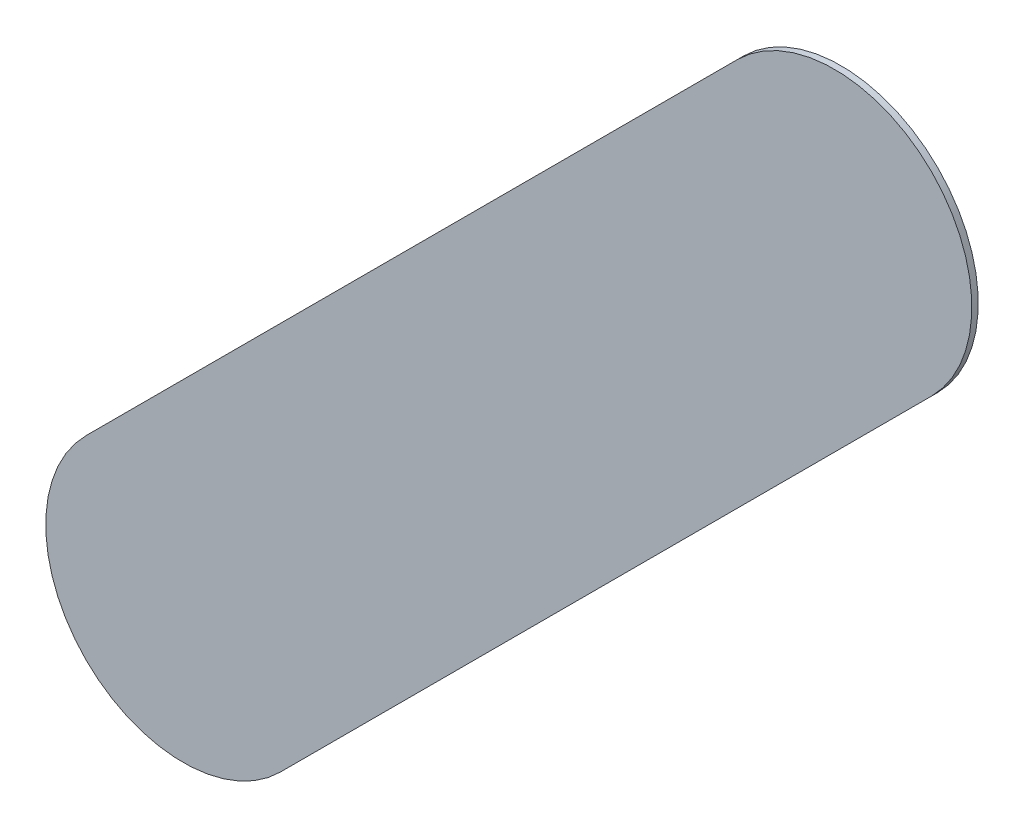
ISO-10303-21;
HEADER;
FILE_DESCRIPTION(('STEP AP214'),'2;1');
FILE_NAME('part.step','',(''),(''),'','','');
FILE_SCHEMA(('AUTOMOTIVE_DESIGN { 1 0 10303 214 1 1 1 1 }'));
ENDSEC;
DATA;
#1=APPLICATION_CONTEXT('core data for automotive mechanical design processes');
#2=APPLICATION_PROTOCOL_DEFINITION('international standard','automotive_design',2000,#1);
#3=PRODUCT_CONTEXT('',#1,'mechanical');
#4=PRODUCT('Part','Part','',(#3));
#5=PRODUCT_RELATED_PRODUCT_CATEGORY('part','',(#4));
#6=PRODUCT_DEFINITION_FORMATION('','',#4);
#7=PRODUCT_DEFINITION_CONTEXT('part definition',#1,'design');
#8=PRODUCT_DEFINITION('design','',#6,#7);
#9=PRODUCT_DEFINITION_SHAPE('','',#8);
#10=(LENGTH_UNIT() NAMED_UNIT(*) SI_UNIT(.MILLI.,.METRE.));
#11=(NAMED_UNIT(*) PLANE_ANGLE_UNIT() SI_UNIT($,.RADIAN.));
#12=(NAMED_UNIT(*) SI_UNIT($,.STERADIAN.) SOLID_ANGLE_UNIT());
#13=UNCERTAINTY_MEASURE_WITH_UNIT(LENGTH_MEASURE(1.E-05),#10,'distance_accuracy_value','');
#14=(GEOMETRIC_REPRESENTATION_CONTEXT(3) GLOBAL_UNCERTAINTY_ASSIGNED_CONTEXT((#13)) GLOBAL_UNIT_ASSIGNED_CONTEXT((#10,
#11,#12)) REPRESENTATION_CONTEXT('',''));
#15=CARTESIAN_POINT('',(0.,0.,0.));
#16=DIRECTION('',(0.,0.,1.));
#17=DIRECTION('',(1.,0.,0.));
#18=AXIS2_PLACEMENT_3D('',#15,#16,#17);
#19=CARTESIAN_POINT('',(161.013669,-141.709669,0.));
#20=DIRECTION('',(0.,0.,1.));
#21=DIRECTION('',(1.,0.,0.));
#22=AXIS2_PLACEMENT_3D('',#19,#20,#21);
#23=PLANE('',#22);
#24=DIRECTION('',(-0.707106781186548,-0.707106781186548,0.));
#25=VECTOR('',#24,1.);
#26=CARTESIAN_POINT('',(161.013669,-141.709669,0.));
#27=LINE('',#26,#25);
#28=CARTESIAN_POINT('',(161.013669,-141.709669,0.));
#29=VERTEX_POINT('',#28);
#30=CARTESIAN_POINT('',(157.457669,-145.265669,0.));
#31=VERTEX_POINT('',#30);
#32=EDGE_CURVE('E98',#29,#31,#27,.T.);
#33=ORIENTED_EDGE('',*,*,#32,.T.);
#34=CARTESIAN_POINT('',(157.9879995,-145.7959995,0.));
#35=DIRECTION('',(0.,0.,1.));
#36=DIRECTION('',(-0.707106781186548,0.707106781186548,0.));
#37=AXIS2_PLACEMENT_3D('',#34,#35,#36);
#38=CIRCLE('',#37,0.75000058564);
#39=CARTESIAN_POINT('',(158.51833,-146.32633,0.));
#40=VERTEX_POINT('',#39);
#41=EDGE_CURVE('E77',#31,#40,#38,.T.);
#42=ORIENTED_EDGE('',*,*,#41,.T.);
#43=DIRECTION('',(0.707106781186548,0.707106781186548,0.));
#44=VECTOR('',#43,1.);
#45=CARTESIAN_POINT('',(158.51833,-146.32633,0.));
#46=LINE('',#45,#44);
#47=CARTESIAN_POINT('',(162.07433,-142.77033,0.));
#48=VERTEX_POINT('',#47);
#49=EDGE_CURVE('E82',#40,#48,#46,.T.);
#50=ORIENTED_EDGE('',*,*,#49,.T.);
#51=CARTESIAN_POINT('',(161.5439995,-142.2399995,0.));
#52=DIRECTION('',(0.,0.,1.));
#53=DIRECTION('',(0.707106781186548,-0.707106781186548,0.));
#54=AXIS2_PLACEMENT_3D('',#51,#52,#53);
#55=CIRCLE('',#54,0.75000058564);
#56=EDGE_CURVE('E11',#48,#29,#55,.T.);
#57=ORIENTED_EDGE('',*,*,#56,.T.);
#58=EDGE_LOOP('',(#33,#42,#50,#57));
#59=FACE_BOUND('',#58,.T.);
#60=ADVANCED_FACE('F17',(#59),#23,.T.);
#61=CARTESIAN_POINT('',(161.013669,-141.709669,-0.035));
#62=DIRECTION('',(0.,0.,1.));
#63=DIRECTION('',(1.,0.,0.));
#64=AXIS2_PLACEMENT_3D('',#61,#62,#63);
#65=PLANE('',#64);
#66=CARTESIAN_POINT('',(161.5439995,-142.2399995,-0.035));
#67=DIRECTION('',(0.,0.,1.));
#68=DIRECTION('',(0.707106781186548,-0.707106781186548,0.));
#69=AXIS2_PLACEMENT_3D('',#66,#67,#68);
#70=CIRCLE('',#69,0.75000058564);
#71=CARTESIAN_POINT('',(162.07433,-142.77033,-0.035));
#72=VERTEX_POINT('',#71);
#73=CARTESIAN_POINT('',(161.013669,-141.709669,-0.035));
#74=VERTEX_POINT('',#73);
#75=EDGE_CURVE('E25',#72,#74,#70,.T.);
#76=ORIENTED_EDGE('',*,*,#75,.F.);
#77=DIRECTION('',(0.707106781186548,0.707106781186548,0.));
#78=VECTOR('',#77,1.);
#79=CARTESIAN_POINT('',(158.51833,-146.32633,-0.035));
#80=LINE('',#79,#78);
#81=CARTESIAN_POINT('',(158.51833,-146.32633,-0.035));
#82=VERTEX_POINT('',#81);
#83=EDGE_CURVE('E67',#82,#72,#80,.T.);
#84=ORIENTED_EDGE('',*,*,#83,.F.);
#85=CARTESIAN_POINT('',(157.9879995,-145.7959995,-0.035));
#86=DIRECTION('',(0.,0.,1.));
#87=DIRECTION('',(-0.707106781186548,0.707106781186548,0.));
#88=AXIS2_PLACEMENT_3D('',#85,#86,#87);
#89=CIRCLE('',#88,0.75000058564);
#90=CARTESIAN_POINT('',(157.457669,-145.265669,-0.035));
#91=VERTEX_POINT('',#90);
#92=EDGE_CURVE('E71',#91,#82,#89,.T.);
#93=ORIENTED_EDGE('',*,*,#92,.F.);
#94=DIRECTION('',(-0.707106781186548,-0.707106781186548,0.));
#95=VECTOR('',#94,1.);
#96=CARTESIAN_POINT('',(161.013669,-141.709669,-0.035));
#97=LINE('',#96,#95);
#98=EDGE_CURVE('E117',#74,#91,#97,.T.);
#99=ORIENTED_EDGE('',*,*,#98,.F.);
#100=EDGE_LOOP('',(#76,#84,#93,#99));
#101=FACE_BOUND('',#100,.T.);
#102=ADVANCED_FACE('F69',(#101),#65,.F.);
#103=CARTESIAN_POINT('',(161.5439995,-142.2399995,-0.035));
#104=DIRECTION('',(0.,0.,-1.));
#105=DIRECTION('',(0.707106781186548,-0.707106781186548,0.));
#106=AXIS2_PLACEMENT_3D('',#103,#104,#105);
#107=CYLINDRICAL_SURFACE('',#106,0.75000058564);
#108=ORIENTED_EDGE('',*,*,#75,.T.);
#109=DIRECTION('',(0.,0.,1.));
#110=VECTOR('',#109,1.);
#111=CARTESIAN_POINT('',(161.013669,-141.709669,-0.035));
#112=LINE('',#111,#110);
#113=EDGE_CURVE('E92',#74,#29,#112,.T.);
#114=ORIENTED_EDGE('',*,*,#113,.T.);
#115=ORIENTED_EDGE('',*,*,#56,.F.);
#116=DIRECTION('',(0.,0.,1.));
#117=VECTOR('',#116,1.);
#118=CARTESIAN_POINT('',(162.07433,-142.77033,-0.035));
#119=LINE('',#118,#117);
#120=EDGE_CURVE('E76',#72,#48,#119,.T.);
#121=ORIENTED_EDGE('',*,*,#120,.F.);
#122=EDGE_LOOP('',(#108,#114,#115,#121));
#123=FACE_BOUND('',#122,.T.);
#124=ADVANCED_FACE('F112',(#123),#107,.T.);
#125=CARTESIAN_POINT('',(158.51833,-146.32633,-0.035));
#126=DIRECTION('',(-0.707106781186548,0.707106781186548,0.));
#127=DIRECTION('',(0.,0.,1.));
#128=AXIS2_PLACEMENT_3D('',#125,#126,#127);
#129=PLANE('',#128);
#130=ORIENTED_EDGE('',*,*,#83,.T.);
#131=ORIENTED_EDGE('',*,*,#120,.T.);
#132=ORIENTED_EDGE('',*,*,#49,.F.);
#133=DIRECTION('',(0.,0.,1.));
#134=VECTOR('',#133,1.);
#135=CARTESIAN_POINT('',(158.51833,-146.32633,-0.035));
#136=LINE('',#135,#134);
#137=EDGE_CURVE('E80',#82,#40,#136,.T.);
#138=ORIENTED_EDGE('',*,*,#137,.F.);
#139=EDGE_LOOP('',(#130,#131,#132,#138));
#140=FACE_BOUND('',#139,.T.);
#141=ADVANCED_FACE('F81',(#140),#129,.F.);
#142=CARTESIAN_POINT('',(157.9879995,-145.7959995,-0.035));
#143=DIRECTION('',(0.,0.,-1.));
#144=DIRECTION('',(-0.707106781186548,0.707106781186548,0.));
#145=AXIS2_PLACEMENT_3D('',#142,#143,#144);
#146=CYLINDRICAL_SURFACE('',#145,0.75000058564);
#147=ORIENTED_EDGE('',*,*,#92,.T.);
#148=ORIENTED_EDGE('',*,*,#137,.T.);
#149=ORIENTED_EDGE('',*,*,#41,.F.);
#150=DIRECTION('',(0.,0.,1.));
#151=VECTOR('',#150,1.);
#152=CARTESIAN_POINT('',(157.457669,-145.265669,-0.035));
#153=LINE('',#152,#151);
#154=EDGE_CURVE('E89',#91,#31,#153,.T.);
#155=ORIENTED_EDGE('',*,*,#154,.F.);
#156=EDGE_LOOP('',(#147,#148,#149,#155));
#157=FACE_BOUND('',#156,.T.);
#158=ADVANCED_FACE('F87',(#157),#146,.T.);
#159=CARTESIAN_POINT('',(161.013669,-141.709669,-0.035));
#160=DIRECTION('',(0.707106781186548,-0.707106781186548,0.));
#161=DIRECTION('',(0.,0.,-1.));
#162=AXIS2_PLACEMENT_3D('',#159,#160,#161);
#163=PLANE('',#162);
#164=ORIENTED_EDGE('',*,*,#98,.T.);
#165=ORIENTED_EDGE('',*,*,#154,.T.);
#166=ORIENTED_EDGE('',*,*,#32,.F.);
#167=ORIENTED_EDGE('',*,*,#113,.F.);
#168=EDGE_LOOP('',(#164,#165,#166,#167));
#169=FACE_BOUND('',#168,.T.);
#170=ADVANCED_FACE('F116',(#169),#163,.F.);
#171=CLOSED_SHELL('',(#60,#102,#124,#141,#158,#170));
#172=MANIFOLD_SOLID_BREP('B1',#171);
#173=ADVANCED_BREP_SHAPE_REPRESENTATION('',(#18,#172),#14);
#174=SHAPE_DEFINITION_REPRESENTATION(#9,#173);
ENDSEC;
END-ISO-10303-21;
